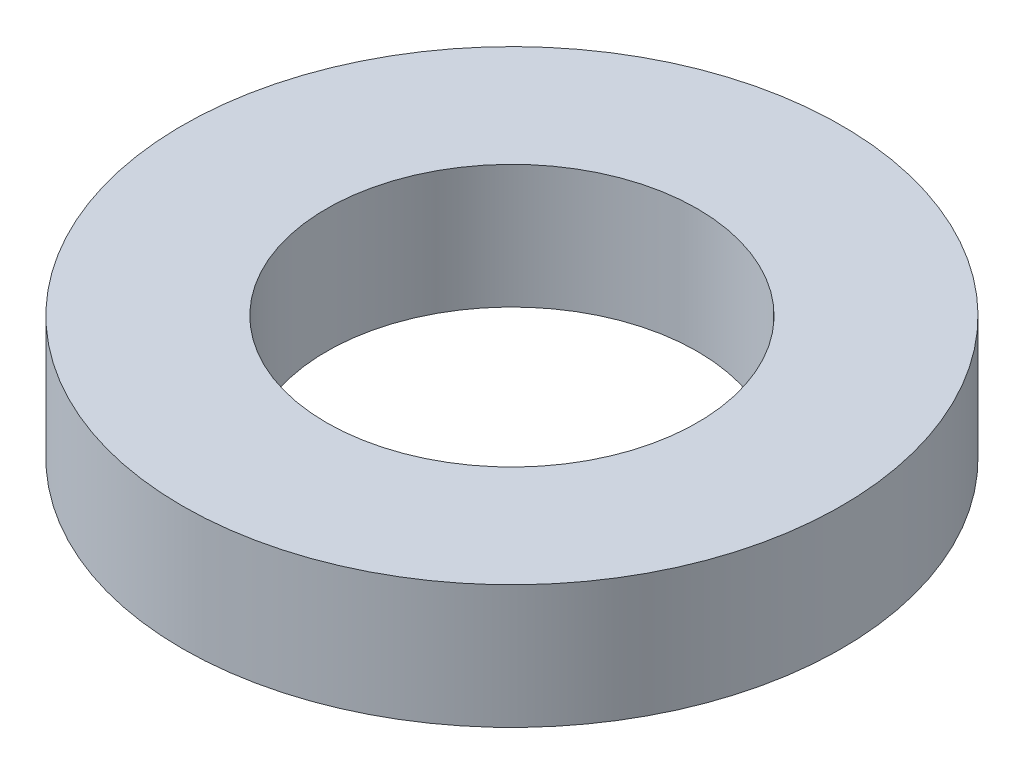
ISO-10303-21;
HEADER;
FILE_DESCRIPTION(('STEP AP214'),'2;1');
FILE_NAME('part.step','',(''),(''),'','','');
FILE_SCHEMA(('AUTOMOTIVE_DESIGN { 1 0 10303 214 1 1 1 1 }'));
ENDSEC;
DATA;
#1=APPLICATION_CONTEXT('core data for automotive mechanical design processes');
#2=APPLICATION_PROTOCOL_DEFINITION('international standard','automotive_design',2000,#1);
#3=PRODUCT_CONTEXT('',#1,'mechanical');
#4=PRODUCT('Part','Part','',(#3));
#5=PRODUCT_RELATED_PRODUCT_CATEGORY('part','',(#4));
#6=PRODUCT_DEFINITION_FORMATION('','',#4);
#7=PRODUCT_DEFINITION_CONTEXT('part definition',#1,'design');
#8=PRODUCT_DEFINITION('design','',#6,#7);
#9=PRODUCT_DEFINITION_SHAPE('','',#8);
#10=(LENGTH_UNIT() NAMED_UNIT(*) SI_UNIT(.MILLI.,.METRE.));
#11=(NAMED_UNIT(*) PLANE_ANGLE_UNIT() SI_UNIT($,.RADIAN.));
#12=(NAMED_UNIT(*) SI_UNIT($,.STERADIAN.) SOLID_ANGLE_UNIT());
#13=UNCERTAINTY_MEASURE_WITH_UNIT(LENGTH_MEASURE(1.E-05),#10,'distance_accuracy_value','');
#14=(GEOMETRIC_REPRESENTATION_CONTEXT(3) GLOBAL_UNCERTAINTY_ASSIGNED_CONTEXT((#13)) GLOBAL_UNIT_ASSIGNED_CONTEXT((#10,
#11,#12)) REPRESENTATION_CONTEXT('',''));
#15=CARTESIAN_POINT('',(0.,0.,0.));
#16=DIRECTION('',(0.,0.,1.));
#17=DIRECTION('',(1.,0.,0.));
#18=AXIS2_PLACEMENT_3D('',#15,#16,#17);
#19=CARTESIAN_POINT('',(0.,30.,0.));
#20=DIRECTION('',(0.,-1.,0.));
#21=DIRECTION('',(0.,0.,-1.));
#22=AXIS2_PLACEMENT_3D('',#19,#20,#21);
#23=CYLINDRICAL_SURFACE('',#22,80.);
#24=CARTESIAN_POINT('',(0.,30.,0.));
#25=DIRECTION('',(0.,1.,0.));
#26=DIRECTION('',(0.,0.,1.));
#27=AXIS2_PLACEMENT_3D('',#24,#25,#26);
#28=CIRCLE('',#27,80.);
#29=CARTESIAN_POINT('',(0.,30.,80.));
#30=VERTEX_POINT('',#29);
#31=EDGE_CURVE('E10',#30,#30,#28,.T.);
#32=ORIENTED_EDGE('',*,*,#31,.F.);
#33=EDGE_LOOP('',(#32));
#34=FACE_BOUND('',#33,.T.);
#35=CARTESIAN_POINT('',(0.,0.,0.));
#36=DIRECTION('',(0.,1.,0.));
#37=DIRECTION('',(0.,0.,1.));
#38=AXIS2_PLACEMENT_3D('',#35,#36,#37);
#39=CIRCLE('',#38,80.);
#40=CARTESIAN_POINT('',(0.,0.,80.));
#41=VERTEX_POINT('',#40);
#42=EDGE_CURVE('E37',#41,#41,#39,.T.);
#43=ORIENTED_EDGE('',*,*,#42,.T.);
#44=EDGE_LOOP('',(#43));
#45=FACE_BOUND('',#44,.T.);
#46=ADVANCED_FACE('F40',(#34,#45),#23,.T.);
#47=CARTESIAN_POINT('',(0.,30.,0.));
#48=DIRECTION('',(0.,1.,0.));
#49=DIRECTION('',(0.,0.,1.));
#50=AXIS2_PLACEMENT_3D('',#47,#48,#49);
#51=PLANE('',#50);
#52=CARTESIAN_POINT('',(0.,30.,0.));
#53=DIRECTION('',(0.,1.,0.));
#54=DIRECTION('',(0.,0.,1.));
#55=AXIS2_PLACEMENT_3D('',#52,#53,#54);
#56=CIRCLE('',#55,45.);
#57=CARTESIAN_POINT('',(0.,30.,45.));
#58=VERTEX_POINT('',#57);
#59=EDGE_CURVE('E50',#58,#58,#56,.T.);
#60=ORIENTED_EDGE('',*,*,#59,.F.);
#61=EDGE_LOOP('',(#60));
#62=FACE_BOUND('',#61,.T.);
#63=ORIENTED_EDGE('',*,*,#31,.T.);
#64=EDGE_LOOP('',(#63));
#65=FACE_BOUND('',#64,.T.);
#66=ADVANCED_FACE('F59',(#62,#65),#51,.T.);
#67=CARTESIAN_POINT('',(0.,0.,0.));
#68=DIRECTION('',(0.,1.,0.));
#69=DIRECTION('',(0.,0.,1.));
#70=AXIS2_PLACEMENT_3D('',#67,#68,#69);
#71=PLANE('',#70);
#72=CARTESIAN_POINT('',(0.,0.,0.));
#73=DIRECTION('',(0.,1.,0.));
#74=DIRECTION('',(0.,0.,1.));
#75=AXIS2_PLACEMENT_3D('',#72,#73,#74);
#76=CIRCLE('',#75,45.);
#77=CARTESIAN_POINT('',(0.,0.,45.));
#78=VERTEX_POINT('',#77);
#79=EDGE_CURVE('E47',#78,#78,#76,.T.);
#80=ORIENTED_EDGE('',*,*,#79,.T.);
#81=EDGE_LOOP('',(#80));
#82=FACE_BOUND('',#81,.T.);
#83=ORIENTED_EDGE('',*,*,#42,.F.);
#84=EDGE_LOOP('',(#83));
#85=FACE_BOUND('',#84,.T.);
#86=ADVANCED_FACE('F58',(#82,#85),#71,.F.);
#87=CARTESIAN_POINT('',(0.,30.,0.));
#88=DIRECTION('',(0.,-1.,0.));
#89=DIRECTION('',(0.,0.,-1.));
#90=AXIS2_PLACEMENT_3D('',#87,#88,#89);
#91=CYLINDRICAL_SURFACE('',#90,45.);
#92=ORIENTED_EDGE('',*,*,#59,.T.);
#93=EDGE_LOOP('',(#92));
#94=FACE_BOUND('',#93,.T.);
#95=ORIENTED_EDGE('',*,*,#79,.F.);
#96=EDGE_LOOP('',(#95));
#97=FACE_BOUND('',#96,.T.);
#98=ADVANCED_FACE('F54',(#94,#97),#91,.F.);
#99=CLOSED_SHELL('',(#46,#66,#86,#98));
#100=MANIFOLD_SOLID_BREP('B2',#99);
#101=ADVANCED_BREP_SHAPE_REPRESENTATION('',(#18,#100),#14);
#102=SHAPE_DEFINITION_REPRESENTATION(#9,#101);
ENDSEC;
END-ISO-10303-21;
